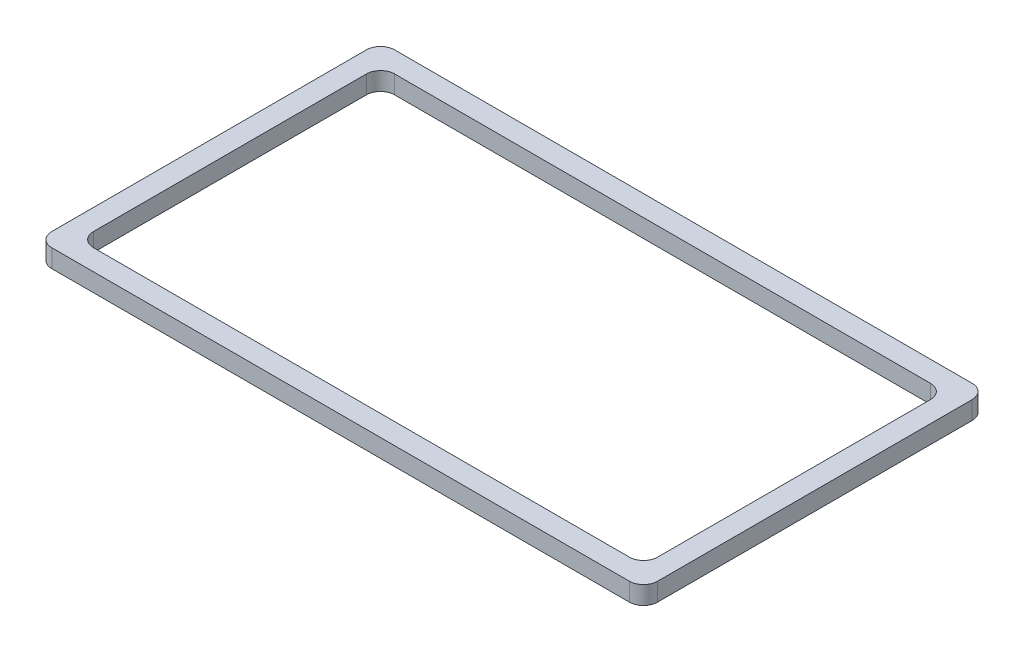
ISO-10303-21;
HEADER;
FILE_DESCRIPTION(('STEP AP214'),'2;1');
FILE_NAME('part.step','',(''),(''),'','','');
FILE_SCHEMA(('AUTOMOTIVE_DESIGN { 1 0 10303 214 1 1 1 1 }'));
ENDSEC;
DATA;
#1=APPLICATION_CONTEXT('core data for automotive mechanical design processes');
#2=APPLICATION_PROTOCOL_DEFINITION('international standard','automotive_design',2000,#1);
#3=PRODUCT_CONTEXT('',#1,'mechanical');
#4=PRODUCT('Part','Part','',(#3));
#5=PRODUCT_RELATED_PRODUCT_CATEGORY('part','',(#4));
#6=PRODUCT_DEFINITION_FORMATION('','',#4);
#7=PRODUCT_DEFINITION_CONTEXT('part definition',#1,'design');
#8=PRODUCT_DEFINITION('design','',#6,#7);
#9=PRODUCT_DEFINITION_SHAPE('','',#8);
#10=(LENGTH_UNIT() NAMED_UNIT(*) SI_UNIT(.MILLI.,.METRE.));
#11=(NAMED_UNIT(*) PLANE_ANGLE_UNIT() SI_UNIT($,.RADIAN.));
#12=(NAMED_UNIT(*) SI_UNIT($,.STERADIAN.) SOLID_ANGLE_UNIT());
#13=UNCERTAINTY_MEASURE_WITH_UNIT(LENGTH_MEASURE(1.E-05),#10,'distance_accuracy_value','');
#14=(GEOMETRIC_REPRESENTATION_CONTEXT(3) GLOBAL_UNCERTAINTY_ASSIGNED_CONTEXT((#13)) GLOBAL_UNIT_ASSIGNED_CONTEXT((#10,
#11,#12)) REPRESENTATION_CONTEXT('',''));
#15=CARTESIAN_POINT('',(0.,0.,0.));
#16=DIRECTION('',(0.,0.,1.));
#17=DIRECTION('',(1.,0.,0.));
#18=AXIS2_PLACEMENT_3D('',#15,#16,#17);
#19=CARTESIAN_POINT('',(0.,2.,0.));
#20=DIRECTION('',(0.,-1.,0.));
#21=DIRECTION('',(0.,0.,-1.));
#22=AXIS2_PLACEMENT_3D('',#19,#20,#21);
#23=PLANE('',#22);
#24=DIRECTION('',(0.,0.,-1.));
#25=VECTOR('',#24,1.);
#26=CARTESIAN_POINT('',(66.8,2.,0.));
#27=LINE('',#26,#25);
#28=CARTESIAN_POINT('',(66.8,2.,-1.55000000000001));
#29=VERTEX_POINT('',#28);
#30=CARTESIAN_POINT('',(66.8,2.,-36.25));
#31=VERTEX_POINT('',#30);
#32=EDGE_CURVE('E173',#29,#31,#27,.T.);
#33=ORIENTED_EDGE('',*,*,#32,.T.);
#34=CARTESIAN_POINT('',(65.25,2.,-36.25));
#35=DIRECTION('',(0.,-1.,0.));
#36=DIRECTION('',(0.,0.,-1.));
#37=AXIS2_PLACEMENT_3D('',#34,#35,#36);
#38=CIRCLE('',#37,1.55);
#39=CARTESIAN_POINT('',(65.25,2.,-37.8));
#40=VERTEX_POINT('',#39);
#41=EDGE_CURVE('E207',#31,#40,#38,.F.);
#42=ORIENTED_EDGE('',*,*,#41,.T.);
#43=DIRECTION('',(-1.,0.,0.));
#44=VECTOR('',#43,1.);
#45=CARTESIAN_POINT('',(0.,2.,-37.8));
#46=LINE('',#45,#44);
#47=CARTESIAN_POINT('',(1.54999999999999,2.,-37.8));
#48=VERTEX_POINT('',#47);
#49=EDGE_CURVE('E168',#40,#48,#46,.T.);
#50=ORIENTED_EDGE('',*,*,#49,.T.);
#51=CARTESIAN_POINT('',(1.54999999999999,2.,-36.25));
#52=DIRECTION('',(0.,-1.,0.));
#53=DIRECTION('',(0.,0.,-1.));
#54=AXIS2_PLACEMENT_3D('',#51,#52,#53);
#55=CIRCLE('',#54,1.55);
#56=CARTESIAN_POINT('',(0.,2.,-36.25));
#57=VERTEX_POINT('',#56);
#58=EDGE_CURVE('E203',#48,#57,#55,.F.);
#59=ORIENTED_EDGE('',*,*,#58,.T.);
#60=DIRECTION('',(0.,0.,1.));
#61=VECTOR('',#60,1.);
#62=CARTESIAN_POINT('',(0.,2.,0.));
#63=LINE('',#62,#61);
#64=CARTESIAN_POINT('',(0.,2.,-1.55));
#65=VERTEX_POINT('',#64);
#66=EDGE_CURVE('E270',#57,#65,#63,.T.);
#67=ORIENTED_EDGE('',*,*,#66,.T.);
#68=CARTESIAN_POINT('',(1.55,2.,-1.55));
#69=DIRECTION('',(0.,-1.,0.));
#70=DIRECTION('',(0.,0.,-1.));
#71=AXIS2_PLACEMENT_3D('',#68,#69,#70);
#72=CIRCLE('',#71,1.55);
#73=CARTESIAN_POINT('',(1.55,2.,0.));
#74=VERTEX_POINT('',#73);
#75=EDGE_CURVE('E201',#65,#74,#72,.F.);
#76=ORIENTED_EDGE('',*,*,#75,.T.);
#77=DIRECTION('',(1.,0.,0.));
#78=VECTOR('',#77,1.);
#79=CARTESIAN_POINT('',(0.,2.,0.));
#80=LINE('',#79,#78);
#81=CARTESIAN_POINT('',(65.25,2.,0.));
#82=VERTEX_POINT('',#81);
#83=EDGE_CURVE('E273',#74,#82,#80,.T.);
#84=ORIENTED_EDGE('',*,*,#83,.T.);
#85=CARTESIAN_POINT('',(65.25,2.,-1.55000000000001));
#86=DIRECTION('',(0.,-1.,0.));
#87=DIRECTION('',(0.,0.,-1.));
#88=AXIS2_PLACEMENT_3D('',#85,#86,#87);
#89=CIRCLE('',#88,1.55);
#90=EDGE_CURVE('E205',#82,#29,#89,.F.);
#91=ORIENTED_EDGE('',*,*,#90,.T.);
#92=EDGE_LOOP('',(#33,#42,#50,#59,#67,#76,#84,#91));
#93=FACE_BOUND('',#92,.T.);
#94=DIRECTION('',(0.,0.,1.));
#95=VECTOR('',#94,1.);
#96=CARTESIAN_POINT('',(2.3,2.,-2.3));
#97=LINE('',#96,#95);
#98=CARTESIAN_POINT('',(2.3,2.,-33.95));
#99=VERTEX_POINT('',#98);
#100=CARTESIAN_POINT('',(2.3,2.,-3.85));
#101=VERTEX_POINT('',#100);
#102=EDGE_CURVE('E254',#99,#101,#97,.T.);
#103=ORIENTED_EDGE('',*,*,#102,.F.);
#104=CARTESIAN_POINT('',(3.85,2.,-33.95));
#105=DIRECTION('',(0.,-1.,0.));
#106=DIRECTION('',(0.,0.,-1.));
#107=AXIS2_PLACEMENT_3D('',#104,#105,#106);
#108=CIRCLE('',#107,1.55);
#109=CARTESIAN_POINT('',(3.85,2.,-35.5));
#110=VERTEX_POINT('',#109);
#111=EDGE_CURVE('E11',#99,#110,#108,.T.);
#112=ORIENTED_EDGE('',*,*,#111,.T.);
#113=DIRECTION('',(-1.,0.,0.));
#114=VECTOR('',#113,1.);
#115=CARTESIAN_POINT('',(2.3,2.,-35.5));
#116=LINE('',#115,#114);
#117=CARTESIAN_POINT('',(62.95,2.,-35.5));
#118=VERTEX_POINT('',#117);
#119=EDGE_CURVE('E252',#118,#110,#116,.T.);
#120=ORIENTED_EDGE('',*,*,#119,.F.);
#121=CARTESIAN_POINT('',(62.95,2.,-33.95));
#122=DIRECTION('',(0.,-1.,0.));
#123=DIRECTION('',(0.,0.,-1.));
#124=AXIS2_PLACEMENT_3D('',#121,#122,#123);
#125=CIRCLE('',#124,1.55);
#126=CARTESIAN_POINT('',(64.5,2.,-33.95));
#127=VERTEX_POINT('',#126);
#128=EDGE_CURVE('E156',#118,#127,#125,.T.);
#129=ORIENTED_EDGE('',*,*,#128,.T.);
#130=DIRECTION('',(0.,0.,-1.));
#131=VECTOR('',#130,1.);
#132=CARTESIAN_POINT('',(64.5,2.,-2.3));
#133=LINE('',#132,#131);
#134=CARTESIAN_POINT('',(64.5,2.,-3.85));
#135=VERTEX_POINT('',#134);
#136=EDGE_CURVE('E259',#135,#127,#133,.T.);
#137=ORIENTED_EDGE('',*,*,#136,.F.);
#138=CARTESIAN_POINT('',(62.95,2.,-3.85));
#139=DIRECTION('',(0.,-1.,0.));
#140=DIRECTION('',(0.,0.,-1.));
#141=AXIS2_PLACEMENT_3D('',#138,#139,#140);
#142=CIRCLE('',#141,1.55);
#143=CARTESIAN_POINT('',(62.95,2.,-2.3));
#144=VERTEX_POINT('',#143);
#145=EDGE_CURVE('E48',#135,#144,#142,.T.);
#146=ORIENTED_EDGE('',*,*,#145,.T.);
#147=DIRECTION('',(1.,0.,0.));
#148=VECTOR('',#147,1.);
#149=CARTESIAN_POINT('',(2.3,2.,-2.3));
#150=LINE('',#149,#148);
#151=CARTESIAN_POINT('',(3.85,2.,-2.3));
#152=VERTEX_POINT('',#151);
#153=EDGE_CURVE('E264',#152,#144,#150,.T.);
#154=ORIENTED_EDGE('',*,*,#153,.F.);
#155=CARTESIAN_POINT('',(3.85,2.,-3.85));
#156=DIRECTION('',(0.,-1.,0.));
#157=DIRECTION('',(0.,0.,-1.));
#158=AXIS2_PLACEMENT_3D('',#155,#156,#157);
#159=CIRCLE('',#158,1.55);
#160=EDGE_CURVE('E233',#152,#101,#159,.T.);
#161=ORIENTED_EDGE('',*,*,#160,.T.);
#162=EDGE_LOOP('',(#103,#112,#120,#129,#137,#146,#154,#161));
#163=FACE_BOUND('',#162,.T.);
#164=ADVANCED_FACE('F33',(#93,#163),#23,.F.);
#165=CARTESIAN_POINT('',(0.,0.,0.));
#166=DIRECTION('',(0.,-1.,0.));
#167=DIRECTION('',(0.,0.,-1.));
#168=AXIS2_PLACEMENT_3D('',#165,#166,#167);
#169=PLANE('',#168);
#170=DIRECTION('',(-1.,0.,0.));
#171=VECTOR('',#170,1.);
#172=CARTESIAN_POINT('',(0.,0.,-37.8));
#173=LINE('',#172,#171);
#174=CARTESIAN_POINT('',(65.25,0.,-37.8));
#175=VERTEX_POINT('',#174);
#176=CARTESIAN_POINT('',(1.54999999999999,0.,-37.8));
#177=VERTEX_POINT('',#176);
#178=EDGE_CURVE('E176',#175,#177,#173,.T.);
#179=ORIENTED_EDGE('',*,*,#178,.F.);
#180=CARTESIAN_POINT('',(65.25,0.,-36.25));
#181=DIRECTION('',(0.,-1.,0.));
#182=DIRECTION('',(0.,0.,-1.));
#183=AXIS2_PLACEMENT_3D('',#180,#181,#182);
#184=CIRCLE('',#183,1.55);
#185=CARTESIAN_POINT('',(66.8,0.,-36.25));
#186=VERTEX_POINT('',#185);
#187=EDGE_CURVE('E194',#175,#186,#184,.T.);
#188=ORIENTED_EDGE('',*,*,#187,.T.);
#189=DIRECTION('',(0.,0.,-1.));
#190=VECTOR('',#189,1.);
#191=CARTESIAN_POINT('',(66.8,0.,0.));
#192=LINE('',#191,#190);
#193=CARTESIAN_POINT('',(66.8,0.,-1.55000000000001));
#194=VERTEX_POINT('',#193);
#195=EDGE_CURVE('E279',#194,#186,#192,.T.);
#196=ORIENTED_EDGE('',*,*,#195,.F.);
#197=CARTESIAN_POINT('',(65.25,0.,-1.55000000000001));
#198=DIRECTION('',(0.,-1.,0.));
#199=DIRECTION('',(0.,0.,-1.));
#200=AXIS2_PLACEMENT_3D('',#197,#198,#199);
#201=CIRCLE('',#200,1.55);
#202=CARTESIAN_POINT('',(65.25,0.,0.));
#203=VERTEX_POINT('',#202);
#204=EDGE_CURVE('E192',#194,#203,#201,.T.);
#205=ORIENTED_EDGE('',*,*,#204,.T.);
#206=DIRECTION('',(1.,0.,0.));
#207=VECTOR('',#206,1.);
#208=CARTESIAN_POINT('',(0.,0.,0.));
#209=LINE('',#208,#207);
#210=CARTESIAN_POINT('',(1.55,0.,0.));
#211=VERTEX_POINT('',#210);
#212=EDGE_CURVE('E262',#211,#203,#209,.T.);
#213=ORIENTED_EDGE('',*,*,#212,.F.);
#214=CARTESIAN_POINT('',(1.55,0.,-1.55));
#215=DIRECTION('',(0.,-1.,0.));
#216=DIRECTION('',(0.,0.,-1.));
#217=AXIS2_PLACEMENT_3D('',#214,#215,#216);
#218=CIRCLE('',#217,1.55);
#219=CARTESIAN_POINT('',(0.,0.,-1.55));
#220=VERTEX_POINT('',#219);
#221=EDGE_CURVE('E188',#211,#220,#218,.T.);
#222=ORIENTED_EDGE('',*,*,#221,.T.);
#223=DIRECTION('',(0.,0.,1.));
#224=VECTOR('',#223,1.);
#225=CARTESIAN_POINT('',(0.,0.,0.));
#226=LINE('',#225,#224);
#227=CARTESIAN_POINT('',(0.,0.,-36.25));
#228=VERTEX_POINT('',#227);
#229=EDGE_CURVE('E258',#228,#220,#226,.T.);
#230=ORIENTED_EDGE('',*,*,#229,.F.);
#231=CARTESIAN_POINT('',(1.54999999999999,0.,-36.25));
#232=DIRECTION('',(0.,-1.,0.));
#233=DIRECTION('',(0.,0.,-1.));
#234=AXIS2_PLACEMENT_3D('',#231,#232,#233);
#235=CIRCLE('',#234,1.55);
#236=EDGE_CURVE('E190',#228,#177,#235,.T.);
#237=ORIENTED_EDGE('',*,*,#236,.T.);
#238=EDGE_LOOP('',(#179,#188,#196,#205,#213,#222,#230,#237));
#239=FACE_BOUND('',#238,.T.);
#240=DIRECTION('',(0.,0.,-1.));
#241=VECTOR('',#240,1.);
#242=CARTESIAN_POINT('',(64.5,0.,-2.3));
#243=LINE('',#242,#241);
#244=CARTESIAN_POINT('',(64.5,0.,-3.85));
#245=VERTEX_POINT('',#244);
#246=CARTESIAN_POINT('',(64.5,0.,-33.95));
#247=VERTEX_POINT('',#246);
#248=EDGE_CURVE('E150',#245,#247,#243,.T.);
#249=ORIENTED_EDGE('',*,*,#248,.T.);
#250=CARTESIAN_POINT('',(62.95,0.,-33.95));
#251=DIRECTION('',(0.,-1.,0.));
#252=DIRECTION('',(0.,0.,-1.));
#253=AXIS2_PLACEMENT_3D('',#250,#251,#252);
#254=CIRCLE('',#253,1.55);
#255=CARTESIAN_POINT('',(62.95,0.,-35.5));
#256=VERTEX_POINT('',#255);
#257=EDGE_CURVE('E227',#247,#256,#254,.F.);
#258=ORIENTED_EDGE('',*,*,#257,.T.);
#259=DIRECTION('',(-1.,0.,0.));
#260=VECTOR('',#259,1.);
#261=CARTESIAN_POINT('',(2.3,0.,-35.5));
#262=LINE('',#261,#260);
#263=CARTESIAN_POINT('',(3.85,0.,-35.5));
#264=VERTEX_POINT('',#263);
#265=EDGE_CURVE('E165',#256,#264,#262,.T.);
#266=ORIENTED_EDGE('',*,*,#265,.T.);
#267=CARTESIAN_POINT('',(3.85,0.,-33.95));
#268=DIRECTION('',(0.,-1.,0.));
#269=DIRECTION('',(0.,0.,-1.));
#270=AXIS2_PLACEMENT_3D('',#267,#268,#269);
#271=CIRCLE('',#270,1.55);
#272=CARTESIAN_POINT('',(2.3,0.,-33.95));
#273=VERTEX_POINT('',#272);
#274=EDGE_CURVE('E41',#264,#273,#271,.F.);
#275=ORIENTED_EDGE('',*,*,#274,.T.);
#276=DIRECTION('',(0.,0.,1.));
#277=VECTOR('',#276,1.);
#278=CARTESIAN_POINT('',(2.3,0.,-2.3));
#279=LINE('',#278,#277);
#280=CARTESIAN_POINT('',(2.3,0.,-3.85));
#281=VERTEX_POINT('',#280);
#282=EDGE_CURVE('E237',#273,#281,#279,.T.);
#283=ORIENTED_EDGE('',*,*,#282,.T.);
#284=CARTESIAN_POINT('',(3.85,0.,-3.85));
#285=DIRECTION('',(0.,-1.,0.));
#286=DIRECTION('',(0.,0.,-1.));
#287=AXIS2_PLACEMENT_3D('',#284,#285,#286);
#288=CIRCLE('',#287,1.55);
#289=CARTESIAN_POINT('',(3.85,0.,-2.3));
#290=VERTEX_POINT('',#289);
#291=EDGE_CURVE('E231',#281,#290,#288,.F.);
#292=ORIENTED_EDGE('',*,*,#291,.T.);
#293=DIRECTION('',(1.,0.,0.));
#294=VECTOR('',#293,1.);
#295=CARTESIAN_POINT('',(2.3,0.,-2.3));
#296=LINE('',#295,#294);
#297=CARTESIAN_POINT('',(62.95,0.,-2.3));
#298=VERTEX_POINT('',#297);
#299=EDGE_CURVE('E151',#290,#298,#296,.T.);
#300=ORIENTED_EDGE('',*,*,#299,.T.);
#301=CARTESIAN_POINT('',(62.95,0.,-3.85));
#302=DIRECTION('',(0.,-1.,0.));
#303=DIRECTION('',(0.,0.,-1.));
#304=AXIS2_PLACEMENT_3D('',#301,#302,#303);
#305=CIRCLE('',#304,1.55);
#306=EDGE_CURVE('E147',#298,#245,#305,.F.);
#307=ORIENTED_EDGE('',*,*,#306,.T.);
#308=EDGE_LOOP('',(#249,#258,#266,#275,#283,#292,#300,#307));
#309=FACE_BOUND('',#308,.T.);
#310=ADVANCED_FACE('F149',(#239,#309),#169,.T.);
#311=CARTESIAN_POINT('',(0.,2.,0.));
#312=DIRECTION('',(1.,0.,0.));
#313=DIRECTION('',(0.,0.,-1.));
#314=AXIS2_PLACEMENT_3D('',#311,#312,#313);
#315=PLANE('',#314);
#316=ORIENTED_EDGE('',*,*,#66,.F.);
#317=DIRECTION('',(0.,-1.,0.));
#318=VECTOR('',#317,1.);
#319=CARTESIAN_POINT('',(0.,2.,-36.25));
#320=LINE('',#319,#318);
#321=EDGE_CURVE('E224',#57,#228,#320,.T.);
#322=ORIENTED_EDGE('',*,*,#321,.T.);
#323=ORIENTED_EDGE('',*,*,#229,.T.);
#324=DIRECTION('',(0.,-1.,0.));
#325=VECTOR('',#324,1.);
#326=CARTESIAN_POINT('',(0.,2.,-1.55));
#327=LINE('',#326,#325);
#328=EDGE_CURVE('E222',#220,#65,#327,.F.);
#329=ORIENTED_EDGE('',*,*,#328,.T.);
#330=EDGE_LOOP('',(#316,#322,#323,#329));
#331=FACE_BOUND('',#330,.T.);
#332=ADVANCED_FACE('F300',(#331),#315,.F.);
#333=CARTESIAN_POINT('',(0.,2.,0.));
#334=DIRECTION('',(0.,0.,-1.));
#335=DIRECTION('',(-1.,0.,0.));
#336=AXIS2_PLACEMENT_3D('',#333,#334,#335);
#337=PLANE('',#336);
#338=ORIENTED_EDGE('',*,*,#212,.T.);
#339=DIRECTION('',(0.,-1.,0.));
#340=VECTOR('',#339,1.);
#341=CARTESIAN_POINT('',(65.25,2.,0.));
#342=LINE('',#341,#340);
#343=EDGE_CURVE('E212',#203,#82,#342,.F.);
#344=ORIENTED_EDGE('',*,*,#343,.T.);
#345=ORIENTED_EDGE('',*,*,#83,.F.);
#346=DIRECTION('',(0.,-1.,0.));
#347=VECTOR('',#346,1.);
#348=CARTESIAN_POINT('',(1.55,2.,0.));
#349=LINE('',#348,#347);
#350=EDGE_CURVE('E209',#74,#211,#349,.T.);
#351=ORIENTED_EDGE('',*,*,#350,.T.);
#352=EDGE_LOOP('',(#338,#344,#345,#351));
#353=FACE_BOUND('',#352,.T.);
#354=ADVANCED_FACE('F308',(#353),#337,.F.);
#355=CARTESIAN_POINT('',(66.8,2.,0.));
#356=DIRECTION('',(-1.,0.,0.));
#357=DIRECTION('',(0.,0.,1.));
#358=AXIS2_PLACEMENT_3D('',#355,#356,#357);
#359=PLANE('',#358);
#360=ORIENTED_EDGE('',*,*,#195,.T.);
#361=DIRECTION('',(0.,-1.,0.));
#362=VECTOR('',#361,1.);
#363=CARTESIAN_POINT('',(66.8,2.,-36.25));
#364=LINE('',#363,#362);
#365=EDGE_CURVE('E199',#186,#31,#364,.F.);
#366=ORIENTED_EDGE('',*,*,#365,.T.);
#367=ORIENTED_EDGE('',*,*,#32,.F.);
#368=DIRECTION('',(0.,-1.,0.));
#369=VECTOR('',#368,1.);
#370=CARTESIAN_POINT('',(66.8,2.,-1.55000000000001));
#371=LINE('',#370,#369);
#372=EDGE_CURVE('E196',#29,#194,#371,.T.);
#373=ORIENTED_EDGE('',*,*,#372,.T.);
#374=EDGE_LOOP('',(#360,#366,#367,#373));
#375=FACE_BOUND('',#374,.T.);
#376=ADVANCED_FACE('F316',(#375),#359,.F.);
#377=CARTESIAN_POINT('',(0.,2.,-37.8));
#378=DIRECTION('',(0.,0.,1.));
#379=DIRECTION('',(1.,0.,0.));
#380=AXIS2_PLACEMENT_3D('',#377,#378,#379);
#381=PLANE('',#380);
#382=ORIENTED_EDGE('',*,*,#49,.F.);
#383=DIRECTION('',(0.,-1.,0.));
#384=VECTOR('',#383,1.);
#385=CARTESIAN_POINT('',(65.25,2.,-37.8));
#386=LINE('',#385,#384);
#387=EDGE_CURVE('E185',#40,#175,#386,.T.);
#388=ORIENTED_EDGE('',*,*,#387,.T.);
#389=ORIENTED_EDGE('',*,*,#178,.T.);
#390=DIRECTION('',(0.,-1.,0.));
#391=VECTOR('',#390,1.);
#392=CARTESIAN_POINT('',(1.54999999999999,2.,-37.8));
#393=LINE('',#392,#391);
#394=EDGE_CURVE('E183',#177,#48,#393,.F.);
#395=ORIENTED_EDGE('',*,*,#394,.T.);
#396=EDGE_LOOP('',(#382,#388,#389,#395));
#397=FACE_BOUND('',#396,.T.);
#398=ADVANCED_FACE('F289',(#397),#381,.F.);
#399=CARTESIAN_POINT('',(2.3,2.,-2.3));
#400=DIRECTION('',(1.,0.,0.));
#401=DIRECTION('',(0.,0.,-1.));
#402=AXIS2_PLACEMENT_3D('',#399,#400,#401);
#403=PLANE('',#402);
#404=ORIENTED_EDGE('',*,*,#102,.T.);
#405=DIRECTION('',(0.,-1.,0.));
#406=VECTOR('',#405,1.);
#407=CARTESIAN_POINT('',(2.3,0.,-3.85));
#408=LINE('',#407,#406);
#409=EDGE_CURVE('E219',#101,#281,#408,.T.);
#410=ORIENTED_EDGE('',*,*,#409,.T.);
#411=ORIENTED_EDGE('',*,*,#282,.F.);
#412=DIRECTION('',(0.,-1.,0.));
#413=VECTOR('',#412,1.);
#414=CARTESIAN_POINT('',(2.3,2.,-33.95));
#415=LINE('',#414,#413);
#416=EDGE_CURVE('E217',#273,#99,#415,.F.);
#417=ORIENTED_EDGE('',*,*,#416,.T.);
#418=EDGE_LOOP('',(#404,#410,#411,#417));
#419=FACE_BOUND('',#418,.T.);
#420=ADVANCED_FACE('F244',(#419),#403,.T.);
#421=CARTESIAN_POINT('',(2.3,2.,-2.3));
#422=DIRECTION('',(0.,0.,-1.));
#423=DIRECTION('',(-1.,0.,0.));
#424=AXIS2_PLACEMENT_3D('',#421,#422,#423);
#425=PLANE('',#424);
#426=ORIENTED_EDGE('',*,*,#153,.T.);
#427=DIRECTION('',(0.,-1.,0.));
#428=VECTOR('',#427,1.);
#429=CARTESIAN_POINT('',(62.95,0.,-2.3));
#430=LINE('',#429,#428);
#431=EDGE_CURVE('E215',#144,#298,#430,.T.);
#432=ORIENTED_EDGE('',*,*,#431,.T.);
#433=ORIENTED_EDGE('',*,*,#299,.F.);
#434=DIRECTION('',(0.,-1.,0.));
#435=VECTOR('',#434,1.);
#436=CARTESIAN_POINT('',(3.85,2.,-2.3));
#437=LINE('',#436,#435);
#438=EDGE_CURVE('E55',#290,#152,#437,.F.);
#439=ORIENTED_EDGE('',*,*,#438,.T.);
#440=EDGE_LOOP('',(#426,#432,#433,#439));
#441=FACE_BOUND('',#440,.T.);
#442=ADVANCED_FACE('F413',(#441),#425,.T.);
#443=CARTESIAN_POINT('',(64.5,2.,-2.3));
#444=DIRECTION('',(-1.,0.,0.));
#445=DIRECTION('',(0.,0.,1.));
#446=AXIS2_PLACEMENT_3D('',#443,#444,#445);
#447=PLANE('',#446);
#448=ORIENTED_EDGE('',*,*,#136,.T.);
#449=DIRECTION('',(0.,-1.,0.));
#450=VECTOR('',#449,1.);
#451=CARTESIAN_POINT('',(64.5,0.,-33.95));
#452=LINE('',#451,#450);
#453=EDGE_CURVE('E164',#127,#247,#452,.T.);
#454=ORIENTED_EDGE('',*,*,#453,.T.);
#455=ORIENTED_EDGE('',*,*,#248,.F.);
#456=DIRECTION('',(0.,-1.,0.));
#457=VECTOR('',#456,1.);
#458=CARTESIAN_POINT('',(64.5,2.,-3.85));
#459=LINE('',#458,#457);
#460=EDGE_CURVE('E162',#245,#135,#459,.F.);
#461=ORIENTED_EDGE('',*,*,#460,.T.);
#462=EDGE_LOOP('',(#448,#454,#455,#461));
#463=FACE_BOUND('',#462,.T.);
#464=ADVANCED_FACE('F161',(#463),#447,.T.);
#465=CARTESIAN_POINT('',(2.3,2.,-35.5));
#466=DIRECTION('',(0.,0.,1.));
#467=DIRECTION('',(1.,0.,0.));
#468=AXIS2_PLACEMENT_3D('',#465,#466,#467);
#469=PLANE('',#468);
#470=ORIENTED_EDGE('',*,*,#265,.F.);
#471=DIRECTION('',(0.,-1.,0.));
#472=VECTOR('',#471,1.);
#473=CARTESIAN_POINT('',(62.95,2.,-35.5));
#474=LINE('',#473,#472);
#475=EDGE_CURVE('E181',#256,#118,#474,.F.);
#476=ORIENTED_EDGE('',*,*,#475,.T.);
#477=ORIENTED_EDGE('',*,*,#119,.T.);
#478=DIRECTION('',(0.,-1.,0.));
#479=VECTOR('',#478,1.);
#480=CARTESIAN_POINT('',(3.85,0.,-35.5));
#481=LINE('',#480,#479);
#482=EDGE_CURVE('E170',#110,#264,#481,.T.);
#483=ORIENTED_EDGE('',*,*,#482,.T.);
#484=EDGE_LOOP('',(#470,#476,#477,#483));
#485=FACE_BOUND('',#484,.T.);
#486=ADVANCED_FACE('F256',(#485),#469,.T.);
#487=CARTESIAN_POINT('',(62.95,2.,-33.95));
#488=DIRECTION('',(0.,1.,0.));
#489=DIRECTION('',(0.,0.,1.));
#490=AXIS2_PLACEMENT_3D('',#487,#488,#489);
#491=CYLINDRICAL_SURFACE('',#490,1.55);
#492=ORIENTED_EDGE('',*,*,#128,.F.);
#493=ORIENTED_EDGE('',*,*,#475,.F.);
#494=ORIENTED_EDGE('',*,*,#257,.F.);
#495=ORIENTED_EDGE('',*,*,#453,.F.);
#496=EDGE_LOOP('',(#492,#493,#494,#495));
#497=FACE_BOUND('',#496,.T.);
#498=ADVANCED_FACE('F335',(#497),#491,.F.);
#499=CARTESIAN_POINT('',(65.25,2.,-36.25));
#500=DIRECTION('',(0.,-1.,0.));
#501=DIRECTION('',(0.,0.,-1.));
#502=AXIS2_PLACEMENT_3D('',#499,#500,#501);
#503=CYLINDRICAL_SURFACE('',#502,1.55);
#504=ORIENTED_EDGE('',*,*,#41,.F.);
#505=ORIENTED_EDGE('',*,*,#365,.F.);
#506=ORIENTED_EDGE('',*,*,#187,.F.);
#507=ORIENTED_EDGE('',*,*,#387,.F.);
#508=EDGE_LOOP('',(#504,#505,#506,#507));
#509=FACE_BOUND('',#508,.T.);
#510=ADVANCED_FACE('F318',(#509),#503,.T.);
#511=CARTESIAN_POINT('',(65.25,2.,-1.55000000000001));
#512=DIRECTION('',(0.,-1.,0.));
#513=DIRECTION('',(0.,0.,-1.));
#514=AXIS2_PLACEMENT_3D('',#511,#512,#513);
#515=CYLINDRICAL_SURFACE('',#514,1.55);
#516=ORIENTED_EDGE('',*,*,#90,.F.);
#517=ORIENTED_EDGE('',*,*,#343,.F.);
#518=ORIENTED_EDGE('',*,*,#204,.F.);
#519=ORIENTED_EDGE('',*,*,#372,.F.);
#520=EDGE_LOOP('',(#516,#517,#518,#519));
#521=FACE_BOUND('',#520,.T.);
#522=ADVANCED_FACE('F312',(#521),#515,.T.);
#523=CARTESIAN_POINT('',(62.95,2.,-3.85));
#524=DIRECTION('',(0.,1.,0.));
#525=DIRECTION('',(0.,0.,1.));
#526=AXIS2_PLACEMENT_3D('',#523,#524,#525);
#527=CYLINDRICAL_SURFACE('',#526,1.55);
#528=ORIENTED_EDGE('',*,*,#145,.F.);
#529=ORIENTED_EDGE('',*,*,#460,.F.);
#530=ORIENTED_EDGE('',*,*,#306,.F.);
#531=ORIENTED_EDGE('',*,*,#431,.F.);
#532=EDGE_LOOP('',(#528,#529,#530,#531));
#533=FACE_BOUND('',#532,.T.);
#534=ADVANCED_FACE('F167',(#533),#527,.F.);
#535=CARTESIAN_POINT('',(3.85,2.,-3.85));
#536=DIRECTION('',(0.,1.,0.));
#537=DIRECTION('',(0.,0.,1.));
#538=AXIS2_PLACEMENT_3D('',#535,#536,#537);
#539=CYLINDRICAL_SURFACE('',#538,1.55);
#540=ORIENTED_EDGE('',*,*,#160,.F.);
#541=ORIENTED_EDGE('',*,*,#438,.F.);
#542=ORIENTED_EDGE('',*,*,#291,.F.);
#543=ORIENTED_EDGE('',*,*,#409,.F.);
#544=EDGE_LOOP('',(#540,#541,#542,#543));
#545=FACE_BOUND('',#544,.T.);
#546=ADVANCED_FACE('F345',(#545),#539,.F.);
#547=CARTESIAN_POINT('',(1.54999999999999,2.,-36.25));
#548=DIRECTION('',(0.,-1.,0.));
#549=DIRECTION('',(0.,0.,-1.));
#550=AXIS2_PLACEMENT_3D('',#547,#548,#549);
#551=CYLINDRICAL_SURFACE('',#550,1.55);
#552=ORIENTED_EDGE('',*,*,#58,.F.);
#553=ORIENTED_EDGE('',*,*,#394,.F.);
#554=ORIENTED_EDGE('',*,*,#236,.F.);
#555=ORIENTED_EDGE('',*,*,#321,.F.);
#556=EDGE_LOOP('',(#552,#553,#554,#555));
#557=FACE_BOUND('',#556,.T.);
#558=ADVANCED_FACE('F294',(#557),#551,.T.);
#559=CARTESIAN_POINT('',(3.85,2.,-33.95));
#560=DIRECTION('',(0.,1.,0.));
#561=DIRECTION('',(0.,0.,1.));
#562=AXIS2_PLACEMENT_3D('',#559,#560,#561);
#563=CYLINDRICAL_SURFACE('',#562,1.55);
#564=ORIENTED_EDGE('',*,*,#111,.F.);
#565=ORIENTED_EDGE('',*,*,#416,.F.);
#566=ORIENTED_EDGE('',*,*,#274,.F.);
#567=ORIENTED_EDGE('',*,*,#482,.F.);
#568=EDGE_LOOP('',(#564,#565,#566,#567));
#569=FACE_BOUND('',#568,.T.);
#570=ADVANCED_FACE('F249',(#569),#563,.F.);
#571=CARTESIAN_POINT('',(1.55,2.,-1.55));
#572=DIRECTION('',(0.,-1.,0.));
#573=DIRECTION('',(0.,0.,-1.));
#574=AXIS2_PLACEMENT_3D('',#571,#572,#573);
#575=CYLINDRICAL_SURFACE('',#574,1.55);
#576=ORIENTED_EDGE('',*,*,#75,.F.);
#577=ORIENTED_EDGE('',*,*,#328,.F.);
#578=ORIENTED_EDGE('',*,*,#221,.F.);
#579=ORIENTED_EDGE('',*,*,#350,.F.);
#580=EDGE_LOOP('',(#576,#577,#578,#579));
#581=FACE_BOUND('',#580,.T.);
#582=ADVANCED_FACE('F35',(#581),#575,.T.);
#583=CLOSED_SHELL('',(#164,#310,#332,#354,#376,#398,#420,#442,#464,#486,#498,#510,#522,#534,
#546,#558,#570,#582));
#584=MANIFOLD_SOLID_BREP('B2',#583);
#585=ADVANCED_BREP_SHAPE_REPRESENTATION('',(#18,#584),#14);
#586=SHAPE_DEFINITION_REPRESENTATION(#9,#585);
ENDSEC;
END-ISO-10303-21;
